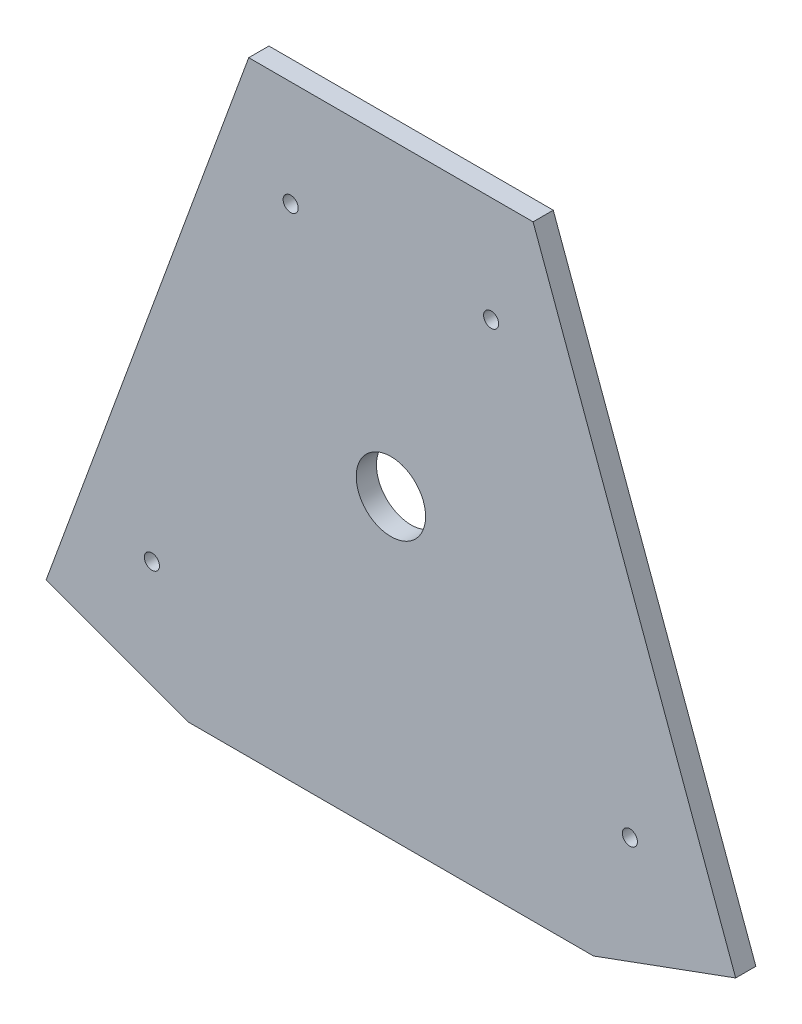
ISO-10303-21;
HEADER;
FILE_DESCRIPTION(('STEP AP214'),'2;1');
FILE_NAME('part.step','',(''),(''),'','','');
FILE_SCHEMA(('AUTOMOTIVE_DESIGN { 1 0 10303 214 1 1 1 1 }'));
ENDSEC;
DATA;
#1=APPLICATION_CONTEXT('core data for automotive mechanical design processes');
#2=APPLICATION_PROTOCOL_DEFINITION('international standard','automotive_design',2000,#1);
#3=PRODUCT_CONTEXT('',#1,'mechanical');
#4=PRODUCT('Part','Part','',(#3));
#5=PRODUCT_RELATED_PRODUCT_CATEGORY('part','',(#4));
#6=PRODUCT_DEFINITION_FORMATION('','',#4);
#7=PRODUCT_DEFINITION_CONTEXT('part definition',#1,'design');
#8=PRODUCT_DEFINITION('design','',#6,#7);
#9=PRODUCT_DEFINITION_SHAPE('','',#8);
#10=(LENGTH_UNIT() NAMED_UNIT(*) SI_UNIT(.MILLI.,.METRE.));
#11=(NAMED_UNIT(*) PLANE_ANGLE_UNIT() SI_UNIT($,.RADIAN.));
#12=(NAMED_UNIT(*) SI_UNIT($,.STERADIAN.) SOLID_ANGLE_UNIT());
#13=UNCERTAINTY_MEASURE_WITH_UNIT(LENGTH_MEASURE(1.E-05),#10,'distance_accuracy_value','');
#14=(GEOMETRIC_REPRESENTATION_CONTEXT(3) GLOBAL_UNCERTAINTY_ASSIGNED_CONTEXT((#13)) GLOBAL_UNIT_ASSIGNED_CONTEXT((#10,
#11,#12)) REPRESENTATION_CONTEXT('',''));
#15=CARTESIAN_POINT('',(0.,0.,0.));
#16=DIRECTION('',(0.,0.,1.));
#17=DIRECTION('',(1.,0.,0.));
#18=AXIS2_PLACEMENT_3D('',#15,#16,#17);
#19=CARTESIAN_POINT('',(-86.7624627975783,-126.210954746984,5.08));
#20=DIRECTION('',(0.939083798908446,-0.343688257913595,0.));
#21=DIRECTION('',(0.343688257913595,0.939083798908446,0.));
#22=AXIS2_PLACEMENT_3D('',#19,#20,#21);
#23=PLANE('',#22);
#24=DIRECTION('',(-0.343688257913595,-0.939083798908446,0.));
#25=VECTOR('',#24,1.);
#26=CARTESIAN_POINT('',(-86.7624627975783,-126.210954746984,0.));
#27=LINE('',#26,#25);
#28=CARTESIAN_POINT('',(-35.7790927384118,13.094522626508,0.));
#29=VERTEX_POINT('',#28);
#30=CARTESIAN_POINT('',(-86.7624627975783,-126.210954746984,0.));
#31=VERTEX_POINT('',#30);
#32=EDGE_CURVE('E119',#29,#31,#27,.T.);
#33=ORIENTED_EDGE('',*,*,#32,.T.);
#34=DIRECTION('',(0.,0.,-1.));
#35=VECTOR('',#34,1.);
#36=CARTESIAN_POINT('',(-86.7624627975783,-126.210954746984,5.08));
#37=LINE('',#36,#35);
#38=CARTESIAN_POINT('',(-86.7624627975783,-126.210954746984,5.08));
#39=VERTEX_POINT('',#38);
#40=EDGE_CURVE('E11',#39,#31,#37,.T.);
#41=ORIENTED_EDGE('',*,*,#40,.F.);
#42=DIRECTION('',(-0.343688257913595,-0.939083798908446,0.));
#43=VECTOR('',#42,1.);
#44=CARTESIAN_POINT('',(-86.7624627975783,-126.210954746984,5.08));
#45=LINE('',#44,#43);
#46=CARTESIAN_POINT('',(-35.7790927384118,13.094522626508,5.08));
#47=VERTEX_POINT('',#46);
#48=EDGE_CURVE('E130',#47,#39,#45,.T.);
#49=ORIENTED_EDGE('',*,*,#48,.F.);
#50=DIRECTION('',(0.,0.,-1.));
#51=VECTOR('',#50,1.);
#52=CARTESIAN_POINT('',(-35.7790927384118,13.094522626508,5.08));
#53=LINE('',#52,#51);
#54=EDGE_CURVE('E115',#47,#29,#53,.T.);
#55=ORIENTED_EDGE('',*,*,#54,.T.);
#56=EDGE_LOOP('',(#33,#41,#49,#55));
#57=FACE_BOUND('',#56,.T.);
#58=ADVANCED_FACE('F34',(#57),#23,.F.);
#59=CARTESIAN_POINT('',(-50.9833700591666,-139.305477373492,5.08));
#60=DIRECTION('',(0.343688257913595,0.939083798908446,0.));
#61=DIRECTION('',(-0.939083798908446,0.343688257913595,0.));
#62=AXIS2_PLACEMENT_3D('',#59,#60,#61);
#63=PLANE('',#62);
#64=DIRECTION('',(0.939083798908446,-0.343688257913595,0.));
#65=VECTOR('',#64,1.);
#66=CARTESIAN_POINT('',(-50.9833700591666,-139.305477373492,0.));
#67=LINE('',#66,#65);
#68=CARTESIAN_POINT('',(-50.9833700591666,-139.305477373492,0.));
#69=VERTEX_POINT('',#68);
#70=EDGE_CURVE('E122',#31,#69,#67,.T.);
#71=ORIENTED_EDGE('',*,*,#70,.T.);
#72=DIRECTION('',(0.,0.,-1.));
#73=VECTOR('',#72,1.);
#74=CARTESIAN_POINT('',(-50.9833700591666,-139.305477373492,5.08));
#75=LINE('',#74,#73);
#76=CARTESIAN_POINT('',(-50.9833700591666,-139.305477373492,5.08));
#77=VERTEX_POINT('',#76);
#78=EDGE_CURVE('E42',#77,#69,#75,.T.);
#79=ORIENTED_EDGE('',*,*,#78,.F.);
#80=DIRECTION('',(0.939083798908446,-0.343688257913595,0.));
#81=VECTOR('',#80,1.);
#82=CARTESIAN_POINT('',(-50.9833700591666,-139.305477373492,5.08));
#83=LINE('',#82,#81);
#84=EDGE_CURVE('E87',#39,#77,#83,.T.);
#85=ORIENTED_EDGE('',*,*,#84,.F.);
#86=ORIENTED_EDGE('',*,*,#40,.T.);
#87=EDGE_LOOP('',(#71,#79,#85,#86));
#88=FACE_BOUND('',#87,.T.);
#89=ADVANCED_FACE('F156',(#88),#63,.F.);
#90=CARTESIAN_POINT('',(50.9833700591667,-139.305477373492,5.08));
#91=DIRECTION('',(0.,1.,0.));
#92=DIRECTION('',(0.,0.,1.));
#93=AXIS2_PLACEMENT_3D('',#90,#91,#92);
#94=PLANE('',#93);
#95=DIRECTION('',(1.,0.,0.));
#96=VECTOR('',#95,1.);
#97=CARTESIAN_POINT('',(50.9833700591667,-139.305477373492,0.));
#98=LINE('',#97,#96);
#99=CARTESIAN_POINT('',(50.9833700591667,-139.305477373492,0.));
#100=VERTEX_POINT('',#99);
#101=EDGE_CURVE('E125',#69,#100,#98,.T.);
#102=ORIENTED_EDGE('',*,*,#101,.T.);
#103=DIRECTION('',(0.,0.,-1.));
#104=VECTOR('',#103,1.);
#105=CARTESIAN_POINT('',(50.9833700591667,-139.305477373492,5.08));
#106=LINE('',#105,#104);
#107=CARTESIAN_POINT('',(50.9833700591667,-139.305477373492,5.08));
#108=VERTEX_POINT('',#107);
#109=EDGE_CURVE('E110',#108,#100,#106,.T.);
#110=ORIENTED_EDGE('',*,*,#109,.F.);
#111=DIRECTION('',(1.,0.,0.));
#112=VECTOR('',#111,1.);
#113=CARTESIAN_POINT('',(50.9833700591667,-139.305477373492,5.08));
#114=LINE('',#113,#112);
#115=EDGE_CURVE('E101',#77,#108,#114,.T.);
#116=ORIENTED_EDGE('',*,*,#115,.F.);
#117=ORIENTED_EDGE('',*,*,#78,.T.);
#118=EDGE_LOOP('',(#102,#110,#116,#117));
#119=FACE_BOUND('',#118,.T.);
#120=ADVANCED_FACE('F136',(#119),#94,.F.);
#121=CARTESIAN_POINT('',(86.7624627975784,-126.210954746984,5.08));
#122=DIRECTION('',(-0.343688257913596,0.939083798908446,0.));
#123=DIRECTION('',(-0.939083798908446,-0.343688257913596,0.));
#124=AXIS2_PLACEMENT_3D('',#121,#122,#123);
#125=PLANE('',#124);
#126=DIRECTION('',(0.939083798908446,0.343688257913596,0.));
#127=VECTOR('',#126,1.);
#128=CARTESIAN_POINT('',(86.7624627975784,-126.210954746984,0.));
#129=LINE('',#128,#127);
#130=CARTESIAN_POINT('',(86.7624627975784,-126.210954746984,0.));
#131=VERTEX_POINT('',#130);
#132=EDGE_CURVE('E109',#100,#131,#129,.T.);
#133=ORIENTED_EDGE('',*,*,#132,.T.);
#134=DIRECTION('',(0.,0.,-1.));
#135=VECTOR('',#134,1.);
#136=CARTESIAN_POINT('',(86.7624627975784,-126.210954746984,5.08));
#137=LINE('',#136,#135);
#138=CARTESIAN_POINT('',(86.7624627975784,-126.210954746984,5.08));
#139=VERTEX_POINT('',#138);
#140=EDGE_CURVE('E106',#139,#131,#137,.T.);
#141=ORIENTED_EDGE('',*,*,#140,.F.);
#142=DIRECTION('',(0.939083798908446,0.343688257913596,0.));
#143=VECTOR('',#142,1.);
#144=CARTESIAN_POINT('',(86.7624627975784,-126.210954746984,5.08));
#145=LINE('',#144,#143);
#146=EDGE_CURVE('E94',#108,#139,#145,.T.);
#147=ORIENTED_EDGE('',*,*,#146,.F.);
#148=ORIENTED_EDGE('',*,*,#109,.T.);
#149=EDGE_LOOP('',(#133,#141,#147,#148));
#150=FACE_BOUND('',#149,.T.);
#151=ADVANCED_FACE('F107',(#150),#125,.F.);
#152=CARTESIAN_POINT('',(35.7790927384117,13.094522626508,5.08));
#153=DIRECTION('',(-0.939083798908446,-0.343688257913596,0.));
#154=DIRECTION('',(0.343688257913596,-0.939083798908446,0.));
#155=AXIS2_PLACEMENT_3D('',#152,#153,#154);
#156=PLANE('',#155);
#157=DIRECTION('',(-0.343688257913596,0.939083798908445,0.));
#158=VECTOR('',#157,1.);
#159=CARTESIAN_POINT('',(35.7790927384117,13.094522626508,0.));
#160=LINE('',#159,#158);
#161=CARTESIAN_POINT('',(35.7790927384117,13.094522626508,0.));
#162=VERTEX_POINT('',#161);
#163=EDGE_CURVE('E73',#131,#162,#160,.T.);
#164=ORIENTED_EDGE('',*,*,#163,.T.);
#165=DIRECTION('',(0.,0.,-1.));
#166=VECTOR('',#165,1.);
#167=CARTESIAN_POINT('',(35.7790927384117,13.094522626508,5.08));
#168=LINE('',#167,#166);
#169=CARTESIAN_POINT('',(35.7790927384117,13.094522626508,5.08));
#170=VERTEX_POINT('',#169);
#171=EDGE_CURVE('E111',#170,#162,#168,.T.);
#172=ORIENTED_EDGE('',*,*,#171,.F.);
#173=DIRECTION('',(-0.343688257913596,0.939083798908445,0.));
#174=VECTOR('',#173,1.);
#175=CARTESIAN_POINT('',(35.7790927384117,13.094522626508,5.08));
#176=LINE('',#175,#174);
#177=EDGE_CURVE('E99',#139,#170,#176,.T.);
#178=ORIENTED_EDGE('',*,*,#177,.F.);
#179=ORIENTED_EDGE('',*,*,#140,.T.);
#180=EDGE_LOOP('',(#164,#172,#178,#179));
#181=FACE_BOUND('',#180,.T.);
#182=ADVANCED_FACE('F113',(#181),#156,.F.);
#183=CARTESIAN_POINT('',(-35.7790927384118,13.094522626508,5.08));
#184=DIRECTION('',(0.,-1.,0.));
#185=DIRECTION('',(0.,0.,-1.));
#186=AXIS2_PLACEMENT_3D('',#183,#184,#185);
#187=PLANE('',#186);
#188=DIRECTION('',(-1.,0.,0.));
#189=VECTOR('',#188,1.);
#190=CARTESIAN_POINT('',(-35.7790927384118,13.094522626508,0.));
#191=LINE('',#190,#189);
#192=EDGE_CURVE('E79',#162,#29,#191,.T.);
#193=ORIENTED_EDGE('',*,*,#192,.T.);
#194=ORIENTED_EDGE('',*,*,#54,.F.);
#195=DIRECTION('',(-1.,0.,0.));
#196=VECTOR('',#195,1.);
#197=CARTESIAN_POINT('',(-35.7790927384118,13.094522626508,5.08));
#198=LINE('',#197,#196);
#199=EDGE_CURVE('E50',#170,#47,#198,.T.);
#200=ORIENTED_EDGE('',*,*,#199,.F.);
#201=ORIENTED_EDGE('',*,*,#171,.T.);
#202=EDGE_LOOP('',(#193,#194,#200,#201));
#203=FACE_BOUND('',#202,.T.);
#204=ADVANCED_FACE('F144',(#203),#187,.F.);
#205=CARTESIAN_POINT('',(0.,0.,5.08));
#206=DIRECTION('',(0.,0.,1.));
#207=DIRECTION('',(1.,0.,0.));
#208=AXIS2_PLACEMENT_3D('',#205,#206,#207);
#209=PLANE('',#208);
#210=CARTESIAN_POINT('',(-60.1432346773671,-108.905487567964,5.08));
#211=DIRECTION('',(0.,0.,1.));
#212=DIRECTION('',(1.,0.,0.));
#213=AXIS2_PLACEMENT_3D('',#210,#211,#212);
#214=CIRCLE('',#213,1.89864999999999);
#215=CARTESIAN_POINT('',(-58.2445846773672,-108.905487567964,5.08));
#216=VERTEX_POINT('',#215);
#217=EDGE_CURVE('E274',#216,#216,#214,.T.);
#218=ORIENTED_EDGE('',*,*,#217,.F.);
#219=EDGE_LOOP('',(#218));
#220=FACE_BOUND('',#219,.T.);
#221=CARTESIAN_POINT('',(-25.2245076733459,-13.4945735988654,5.08));
#222=DIRECTION('',(0.,0.,1.));
#223=DIRECTION('',(1.,0.,0.));
#224=AXIS2_PLACEMENT_3D('',#221,#222,#223);
#225=CIRCLE('',#224,1.89864999999999);
#226=CARTESIAN_POINT('',(-23.3258576733459,-13.4945735988654,5.08));
#227=VERTEX_POINT('',#226);
#228=EDGE_CURVE('E282',#227,#227,#225,.T.);
#229=ORIENTED_EDGE('',*,*,#228,.F.);
#230=EDGE_LOOP('',(#229));
#231=FACE_BOUND('',#230,.T.);
#232=CARTESIAN_POINT('',(25.2245076733458,-13.4945735988654,5.08));
#233=DIRECTION('',(0.,0.,1.));
#234=DIRECTION('',(1.,0.,0.));
#235=AXIS2_PLACEMENT_3D('',#232,#233,#234);
#236=CIRCLE('',#235,1.89864999999999);
#237=CARTESIAN_POINT('',(27.1231576733458,-13.4945735988654,5.08));
#238=VERTEX_POINT('',#237);
#239=EDGE_CURVE('E288',#238,#238,#236,.T.);
#240=ORIENTED_EDGE('',*,*,#239,.F.);
#241=EDGE_LOOP('',(#240));
#242=FACE_BOUND('',#241,.T.);
#243=CARTESIAN_POINT('',(60.1432346773672,-108.905487567964,5.08));
#244=DIRECTION('',(0.,0.,1.));
#245=DIRECTION('',(1.,0.,0.));
#246=AXIS2_PLACEMENT_3D('',#243,#244,#245);
#247=CIRCLE('',#246,1.89864999999999);
#248=CARTESIAN_POINT('',(62.0418846773672,-108.905487567964,5.08));
#249=VERTEX_POINT('',#248);
#250=EDGE_CURVE('E294',#249,#249,#247,.T.);
#251=ORIENTED_EDGE('',*,*,#250,.F.);
#252=EDGE_LOOP('',(#251));
#253=FACE_BOUND('',#252,.T.);
#254=ORIENTED_EDGE('',*,*,#48,.T.);
#255=ORIENTED_EDGE('',*,*,#84,.T.);
#256=ORIENTED_EDGE('',*,*,#115,.T.);
#257=ORIENTED_EDGE('',*,*,#146,.T.);
#258=ORIENTED_EDGE('',*,*,#177,.T.);
#259=ORIENTED_EDGE('',*,*,#199,.T.);
#260=EDGE_LOOP('',(#254,#255,#256,#257,#258,#259));
#261=FACE_BOUND('',#260,.T.);
#262=CARTESIAN_POINT('',(0.,-64.6661603597394,5.08));
#263=DIRECTION('',(0.,0.,1.));
#264=DIRECTION('',(1.,0.,0.));
#265=AXIS2_PLACEMENT_3D('',#262,#263,#264);
#266=CIRCLE('',#265,8.73125);
#267=CARTESIAN_POINT('',(8.73125,-64.6661603597394,5.08));
#268=VERTEX_POINT('',#267);
#269=EDGE_CURVE('E272',#268,#268,#266,.T.);
#270=ORIENTED_EDGE('',*,*,#269,.F.);
#271=EDGE_LOOP('',(#270));
#272=FACE_BOUND('',#271,.T.);
#273=ADVANCED_FACE('F96',(#220,#231,#242,#253,#261,#272),#209,.T.);
#274=CARTESIAN_POINT('',(0.,0.,0.));
#275=DIRECTION('',(0.,0.,1.));
#276=DIRECTION('',(1.,0.,0.));
#277=AXIS2_PLACEMENT_3D('',#274,#275,#276);
#278=PLANE('',#277);
#279=CARTESIAN_POINT('',(-60.1432346773671,-108.905487567964,0.));
#280=DIRECTION('',(0.,0.,1.));
#281=DIRECTION('',(1.,0.,0.));
#282=AXIS2_PLACEMENT_3D('',#279,#280,#281);
#283=CIRCLE('',#282,1.89864999999999);
#284=CARTESIAN_POINT('',(-58.2445846773672,-108.905487567964,0.));
#285=VERTEX_POINT('',#284);
#286=EDGE_CURVE('E279',#285,#285,#283,.T.);
#287=ORIENTED_EDGE('',*,*,#286,.T.);
#288=EDGE_LOOP('',(#287));
#289=FACE_BOUND('',#288,.T.);
#290=CARTESIAN_POINT('',(-25.2245076733459,-13.4945735988654,0.));
#291=DIRECTION('',(0.,0.,1.));
#292=DIRECTION('',(1.,0.,0.));
#293=AXIS2_PLACEMENT_3D('',#290,#291,#292);
#294=CIRCLE('',#293,1.89865);
#295=CARTESIAN_POINT('',(-23.3258576733459,-13.4945735988654,0.));
#296=VERTEX_POINT('',#295);
#297=EDGE_CURVE('E285',#296,#296,#294,.T.);
#298=ORIENTED_EDGE('',*,*,#297,.T.);
#299=EDGE_LOOP('',(#298));
#300=FACE_BOUND('',#299,.T.);
#301=CARTESIAN_POINT('',(25.2245076733458,-13.4945735988654,0.));
#302=DIRECTION('',(0.,0.,1.));
#303=DIRECTION('',(1.,0.,0.));
#304=AXIS2_PLACEMENT_3D('',#301,#302,#303);
#305=CIRCLE('',#304,1.89865);
#306=CARTESIAN_POINT('',(27.1231576733458,-13.4945735988654,0.));
#307=VERTEX_POINT('',#306);
#308=EDGE_CURVE('E291',#307,#307,#305,.T.);
#309=ORIENTED_EDGE('',*,*,#308,.T.);
#310=EDGE_LOOP('',(#309));
#311=FACE_BOUND('',#310,.T.);
#312=CARTESIAN_POINT('',(60.1432346773672,-108.905487567964,0.));
#313=DIRECTION('',(0.,0.,1.));
#314=DIRECTION('',(1.,0.,0.));
#315=AXIS2_PLACEMENT_3D('',#312,#313,#314);
#316=CIRCLE('',#315,1.89864999999999);
#317=CARTESIAN_POINT('',(62.0418846773672,-108.905487567964,0.));
#318=VERTEX_POINT('',#317);
#319=EDGE_CURVE('E123',#318,#318,#316,.T.);
#320=ORIENTED_EDGE('',*,*,#319,.T.);
#321=EDGE_LOOP('',(#320));
#322=FACE_BOUND('',#321,.T.);
#323=ORIENTED_EDGE('',*,*,#32,.F.);
#324=ORIENTED_EDGE('',*,*,#192,.F.);
#325=ORIENTED_EDGE('',*,*,#163,.F.);
#326=ORIENTED_EDGE('',*,*,#132,.F.);
#327=ORIENTED_EDGE('',*,*,#101,.F.);
#328=ORIENTED_EDGE('',*,*,#70,.F.);
#329=EDGE_LOOP('',(#323,#324,#325,#326,#327,#328));
#330=FACE_BOUND('',#329,.T.);
#331=CARTESIAN_POINT('',(0.,-64.6661603597394,0.));
#332=DIRECTION('',(0.,0.,1.));
#333=DIRECTION('',(1.,0.,0.));
#334=AXIS2_PLACEMENT_3D('',#331,#332,#333);
#335=CIRCLE('',#334,8.73125);
#336=CARTESIAN_POINT('',(8.73125,-64.6661603597394,0.));
#337=VERTEX_POINT('',#336);
#338=EDGE_CURVE('E269',#337,#337,#335,.F.);
#339=ORIENTED_EDGE('',*,*,#338,.F.);
#340=EDGE_LOOP('',(#339));
#341=FACE_BOUND('',#340,.T.);
#342=ADVANCED_FACE('F139',(#289,#300,#311,#322,#330,#341),#278,.F.);
#343=CARTESIAN_POINT('',(60.1432346773672,-108.905487567964,5.08));
#344=DIRECTION('',(0.,0.,1.));
#345=DIRECTION('',(1.,0.,0.));
#346=AXIS2_PLACEMENT_3D('',#343,#344,#345);
#347=CYLINDRICAL_SURFACE('',#346,1.89864999999999);
#348=ORIENTED_EDGE('',*,*,#319,.F.);
#349=EDGE_LOOP('',(#348));
#350=FACE_BOUND('',#349,.T.);
#351=ORIENTED_EDGE('',*,*,#250,.T.);
#352=EDGE_LOOP('',(#351));
#353=FACE_BOUND('',#352,.T.);
#354=ADVANCED_FACE('F205',(#350,#353),#347,.F.);
#355=CARTESIAN_POINT('',(25.2245076733458,-13.4945735988654,5.08));
#356=DIRECTION('',(0.,0.,1.));
#357=DIRECTION('',(1.,0.,0.));
#358=AXIS2_PLACEMENT_3D('',#355,#356,#357);
#359=CYLINDRICAL_SURFACE('',#358,1.89864999999999);
#360=ORIENTED_EDGE('',*,*,#308,.F.);
#361=EDGE_LOOP('',(#360));
#362=FACE_BOUND('',#361,.T.);
#363=ORIENTED_EDGE('',*,*,#239,.T.);
#364=EDGE_LOOP('',(#363));
#365=FACE_BOUND('',#364,.T.);
#366=ADVANCED_FACE('F223',(#362,#365),#359,.F.);
#367=CARTESIAN_POINT('',(-25.2245076733459,-13.4945735988654,5.08));
#368=DIRECTION('',(0.,0.,1.));
#369=DIRECTION('',(1.,0.,0.));
#370=AXIS2_PLACEMENT_3D('',#367,#368,#369);
#371=CYLINDRICAL_SURFACE('',#370,1.89864999999999);
#372=ORIENTED_EDGE('',*,*,#297,.F.);
#373=EDGE_LOOP('',(#372));
#374=FACE_BOUND('',#373,.T.);
#375=ORIENTED_EDGE('',*,*,#228,.T.);
#376=EDGE_LOOP('',(#375));
#377=FACE_BOUND('',#376,.T.);
#378=ADVANCED_FACE('F233',(#374,#377),#371,.F.);
#379=CARTESIAN_POINT('',(-60.1432346773671,-108.905487567964,5.08));
#380=DIRECTION('',(0.,0.,1.));
#381=DIRECTION('',(1.,0.,0.));
#382=AXIS2_PLACEMENT_3D('',#379,#380,#381);
#383=CYLINDRICAL_SURFACE('',#382,1.89864999999999);
#384=ORIENTED_EDGE('',*,*,#286,.F.);
#385=EDGE_LOOP('',(#384));
#386=FACE_BOUND('',#385,.T.);
#387=ORIENTED_EDGE('',*,*,#217,.T.);
#388=EDGE_LOOP('',(#387));
#389=FACE_BOUND('',#388,.T.);
#390=ADVANCED_FACE('F243',(#386,#389),#383,.F.);
#391=CARTESIAN_POINT('',(0.,-64.6661603597394,-62.8617928474841));
#392=DIRECTION('',(0.,0.,1.));
#393=DIRECTION('',(1.,0.,0.));
#394=AXIS2_PLACEMENT_3D('',#391,#392,#393);
#395=CYLINDRICAL_SURFACE('',#394,8.73125);
#396=ORIENTED_EDGE('',*,*,#338,.T.);
#397=EDGE_LOOP('',(#396));
#398=FACE_BOUND('',#397,.T.);
#399=ORIENTED_EDGE('',*,*,#269,.T.);
#400=EDGE_LOOP('',(#399));
#401=FACE_BOUND('',#400,.T.);
#402=ADVANCED_FACE('F253',(#398,#401),#395,.F.);
#403=CLOSED_SHELL('',(#58,#89,#120,#151,#182,#204,#273,#342,#354,#366,#378,#390,#402));
#404=MANIFOLD_SOLID_BREP('B2',#403);
#405=ADVANCED_BREP_SHAPE_REPRESENTATION('',(#18,#404),#14);
#406=SHAPE_DEFINITION_REPRESENTATION(#9,#405);
ENDSEC;
END-ISO-10303-21;
